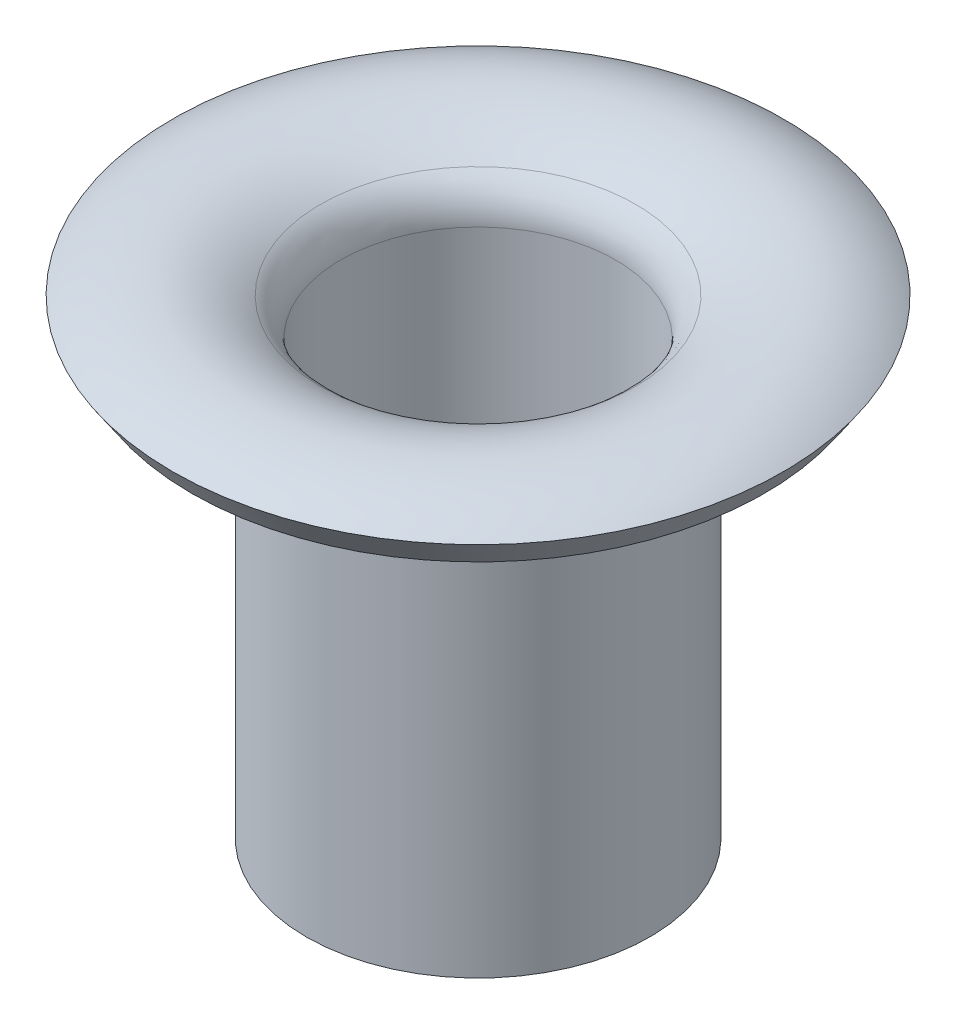
ISO-10303-21;
HEADER;
FILE_DESCRIPTION(('STEP AP214'),'2;1');
FILE_NAME('part.step','',(''),(''),'','','');
FILE_SCHEMA(('AUTOMOTIVE_DESIGN { 1 0 10303 214 1 1 1 1 }'));
ENDSEC;
DATA;
#1=APPLICATION_CONTEXT('core data for automotive mechanical design processes');
#2=APPLICATION_PROTOCOL_DEFINITION('international standard','automotive_design',2000,#1);
#3=PRODUCT_CONTEXT('',#1,'mechanical');
#4=PRODUCT('Part','Part','',(#3));
#5=PRODUCT_RELATED_PRODUCT_CATEGORY('part','',(#4));
#6=PRODUCT_DEFINITION_FORMATION('','',#4);
#7=PRODUCT_DEFINITION_CONTEXT('part definition',#1,'design');
#8=PRODUCT_DEFINITION('design','',#6,#7);
#9=PRODUCT_DEFINITION_SHAPE('','',#8);
#10=(LENGTH_UNIT() NAMED_UNIT(*) SI_UNIT(.MILLI.,.METRE.));
#11=(NAMED_UNIT(*) PLANE_ANGLE_UNIT() SI_UNIT($,.RADIAN.));
#12=(NAMED_UNIT(*) SI_UNIT($,.STERADIAN.) SOLID_ANGLE_UNIT());
#13=UNCERTAINTY_MEASURE_WITH_UNIT(LENGTH_MEASURE(1.E-05),#10,'distance_accuracy_value','');
#14=(GEOMETRIC_REPRESENTATION_CONTEXT(3) GLOBAL_UNCERTAINTY_ASSIGNED_CONTEXT((#13)) GLOBAL_UNIT_ASSIGNED_CONTEXT((#10,
#11,#12)) REPRESENTATION_CONTEXT('',''));
#15=CARTESIAN_POINT('',(0.,0.,0.));
#16=DIRECTION('',(0.,0.,1.));
#17=DIRECTION('',(1.,0.,0.));
#18=AXIS2_PLACEMENT_3D('',#15,#16,#17);
#19=CARTESIAN_POINT('',(0.,-0.709789878499906,0.));
#20=DIRECTION('',(0.,1.,0.));
#21=DIRECTION('',(0.,0.,1.));
#22=AXIS2_PLACEMENT_3D('',#19,#20,#21);
#23=TOROIDAL_SURFACE('',#22,2.02207382331385,0.85569568304553);
#24=CARTESIAN_POINT('',(0.,0.,0.));
#25=DIRECTION('',(0.,1.,0.));
#26=DIRECTION('',(0.,0.,1.));
#27=AXIS2_PLACEMENT_3D('',#24,#25,#26);
#28=CIRCLE('',#27,2.5);
#29=CARTESIAN_POINT('',(0.,0.,2.5));
#30=VERTEX_POINT('',#29);
#31=EDGE_CURVE('E59',#30,#30,#28,.T.);
#32=ORIENTED_EDGE('',*,*,#31,.F.);
#33=EDGE_LOOP('',(#32));
#34=FACE_BOUND('',#33,.T.);
#35=CARTESIAN_POINT('',(0.,0.,0.));
#36=DIRECTION('',(0.,1.,0.));
#37=DIRECTION('',(0.,0.,1.));
#38=AXIS2_PLACEMENT_3D('',#35,#36,#37);
#39=CIRCLE('',#38,1.54414764662769);
#40=CARTESIAN_POINT('',(0.,0.,1.54414764662769));
#41=VERTEX_POINT('',#40);
#42=EDGE_CURVE('E10',#41,#41,#39,.T.);
#43=ORIENTED_EDGE('',*,*,#42,.T.);
#44=EDGE_LOOP('',(#43));
#45=FACE_BOUND('',#44,.T.);
#46=ADVANCED_FACE('F31',(#34,#45),#23,.F.);
#47=CARTESIAN_POINT('',(0.,-0.0829488675195459,0.));
#48=DIRECTION('',(0.,1.,0.));
#49=DIRECTION('',(0.,0.,1.));
#50=AXIS2_PLACEMENT_3D('',#47,#48,#49);
#51=TOROIDAL_SURFACE('',#50,1.6,0.1);
#52=ORIENTED_EDGE('',*,*,#42,.F.);
#53=EDGE_LOOP('',(#52));
#54=FACE_BOUND('',#53,.T.);
#55=CARTESIAN_POINT('',(0.,-0.0829488675195459,0.));
#56=DIRECTION('',(0.,1.,0.));
#57=DIRECTION('',(0.,0.,1.));
#58=AXIS2_PLACEMENT_3D('',#55,#56,#57);
#59=CIRCLE('',#58,1.5);
#60=CARTESIAN_POINT('',(0.,-0.0829488675195459,1.5));
#61=VERTEX_POINT('',#60);
#62=EDGE_CURVE('E37',#61,#61,#59,.T.);
#63=ORIENTED_EDGE('',*,*,#62,.T.);
#64=EDGE_LOOP('',(#63));
#65=FACE_BOUND('',#64,.T.);
#66=ADVANCED_FACE('F67',(#54,#65),#51,.F.);
#67=CARTESIAN_POINT('',(0.,0.,0.));
#68=DIRECTION('',(0.,1.,0.));
#69=DIRECTION('',(0.,0.,1.));
#70=AXIS2_PLACEMENT_3D('',#67,#68,#69);
#71=CYLINDRICAL_SURFACE('',#70,1.5);
#72=ORIENTED_EDGE('',*,*,#62,.F.);
#73=EDGE_LOOP('',(#72));
#74=FACE_BOUND('',#73,.T.);
#75=CARTESIAN_POINT('',(0.,-3.85409419545438,0.));
#76=DIRECTION('',(0.,1.,0.));
#77=DIRECTION('',(0.,0.,1.));
#78=AXIS2_PLACEMENT_3D('',#75,#76,#77);
#79=CIRCLE('',#78,1.5);
#80=CARTESIAN_POINT('',(0.,-3.85409419545438,1.5));
#81=VERTEX_POINT('',#80);
#82=EDGE_CURVE('E41',#81,#81,#79,.T.);
#83=ORIENTED_EDGE('',*,*,#82,.T.);
#84=EDGE_LOOP('',(#83));
#85=FACE_BOUND('',#84,.T.);
#86=ADVANCED_FACE('F71',(#74,#85),#71,.T.);
#87=CARTESIAN_POINT('',(1.5,-3.85409419545438,0.));
#88=DIRECTION('',(0.,-1.,0.));
#89=DIRECTION('',(0.,0.,-1.));
#90=AXIS2_PLACEMENT_3D('',#87,#88,#89);
#91=PLANE('',#90);
#92=CARTESIAN_POINT('',(0.,-3.85409419545438,0.));
#93=DIRECTION('',(0.,1.,0.));
#94=DIRECTION('',(0.,0.,1.));
#95=AXIS2_PLACEMENT_3D('',#92,#93,#94);
#96=CIRCLE('',#95,1.2);
#97=CARTESIAN_POINT('',(0.,-3.85409419545438,1.2));
#98=VERTEX_POINT('',#97);
#99=EDGE_CURVE('E45',#98,#98,#96,.T.);
#100=ORIENTED_EDGE('',*,*,#99,.T.);
#101=EDGE_LOOP('',(#100));
#102=FACE_BOUND('',#101,.T.);
#103=ORIENTED_EDGE('',*,*,#82,.F.);
#104=EDGE_LOOP('',(#103));
#105=FACE_BOUND('',#104,.T.);
#106=ADVANCED_FACE('F76',(#102,#105),#91,.T.);
#107=CARTESIAN_POINT('',(0.,0.,0.));
#108=DIRECTION('',(0.,1.,0.));
#109=DIRECTION('',(0.,0.,1.));
#110=AXIS2_PLACEMENT_3D('',#107,#108,#109);
#111=CYLINDRICAL_SURFACE('',#110,1.2);
#112=CARTESIAN_POINT('',(0.,-0.0829488675195458,0.));
#113=DIRECTION('',(0.,1.,0.));
#114=DIRECTION('',(0.,0.,1.));
#115=AXIS2_PLACEMENT_3D('',#112,#113,#114);
#116=CIRCLE('',#115,1.2);
#117=CARTESIAN_POINT('',(0.,-0.0829488675195458,1.2));
#118=VERTEX_POINT('',#117);
#119=EDGE_CURVE('E50',#118,#118,#116,.T.);
#120=ORIENTED_EDGE('',*,*,#119,.T.);
#121=EDGE_LOOP('',(#120));
#122=FACE_BOUND('',#121,.T.);
#123=ORIENTED_EDGE('',*,*,#99,.F.);
#124=EDGE_LOOP('',(#123));
#125=FACE_BOUND('',#124,.T.);
#126=ADVANCED_FACE('F82',(#122,#125),#111,.F.);
#127=CARTESIAN_POINT('',(0.,-0.0829488675195459,0.));
#128=DIRECTION('',(0.,1.,0.));
#129=DIRECTION('',(0.,0.,1.));
#130=AXIS2_PLACEMENT_3D('',#127,#128,#129);
#131=TOROIDAL_SURFACE('',#130,1.6,0.4);
#132=CARTESIAN_POINT('',(0.,0.248846602558637,0.));
#133=DIRECTION('',(0.,1.,0.));
#134=DIRECTION('',(0.,0.,1.));
#135=AXIS2_PLACEMENT_3D('',#132,#133,#134);
#136=CIRCLE('',#135,1.37659058651078);
#137=CARTESIAN_POINT('',(0.,0.248846602558637,1.37659058651078));
#138=VERTEX_POINT('',#137);
#139=EDGE_CURVE('E53',#138,#138,#136,.T.);
#140=ORIENTED_EDGE('',*,*,#139,.T.);
#141=EDGE_LOOP('',(#140));
#142=FACE_BOUND('',#141,.T.);
#143=ORIENTED_EDGE('',*,*,#119,.F.);
#144=EDGE_LOOP('',(#143));
#145=FACE_BOUND('',#144,.T.);
#146=ADVANCED_FACE('F86',(#142,#145),#131,.T.);
#147=CARTESIAN_POINT('',(0.,-0.709789878499906,0.));
#148=DIRECTION('',(0.,1.,0.));
#149=DIRECTION('',(0.,0.,1.));
#150=AXIS2_PLACEMENT_3D('',#147,#148,#149);
#151=TOROIDAL_SURFACE('',#150,2.02207382331385,1.15569568304553);
#152=CARTESIAN_POINT('',(0.,0.248846602558636,0.));
#153=DIRECTION('',(0.,1.,0.));
#154=DIRECTION('',(0.,0.,1.));
#155=AXIS2_PLACEMENT_3D('',#152,#153,#154);
#156=CIRCLE('',#155,2.66755706011692);
#157=CARTESIAN_POINT('',(0.,0.248846602558636,2.66755706011692));
#158=VERTEX_POINT('',#157);
#159=EDGE_CURVE('E56',#158,#158,#156,.T.);
#160=ORIENTED_EDGE('',*,*,#159,.T.);
#161=EDGE_LOOP('',(#160));
#162=FACE_BOUND('',#161,.T.);
#163=ORIENTED_EDGE('',*,*,#139,.F.);
#164=EDGE_LOOP('',(#163));
#165=FACE_BOUND('',#164,.T.);
#166=ADVANCED_FACE('F90',(#162,#165),#151,.T.);
#167=CARTESIAN_POINT('',(0.,0.248846602558636,0.));
#168=DIRECTION('',(0.,1.,0.));
#169=DIRECTION('',(0.,0.,1.));
#170=AXIS2_PLACEMENT_3D('',#167,#168,#169);
#171=CONICAL_SURFACE('',#170,2.66755706011692,0.592604759524397);
#172=ORIENTED_EDGE('',*,*,#31,.T.);
#173=EDGE_LOOP('',(#172));
#174=FACE_BOUND('',#173,.T.);
#175=ORIENTED_EDGE('',*,*,#159,.F.);
#176=EDGE_LOOP('',(#175));
#177=FACE_BOUND('',#176,.T.);
#178=ADVANCED_FACE('F63',(#174,#177),#171,.T.);
#179=CLOSED_SHELL('',(#46,#66,#86,#106,#126,#146,#166,#178));
#180=MANIFOLD_SOLID_BREP('B2',#179);
#181=ADVANCED_BREP_SHAPE_REPRESENTATION('',(#18,#180),#14);
#182=SHAPE_DEFINITION_REPRESENTATION(#9,#181);
ENDSEC;
END-ISO-10303-21;
